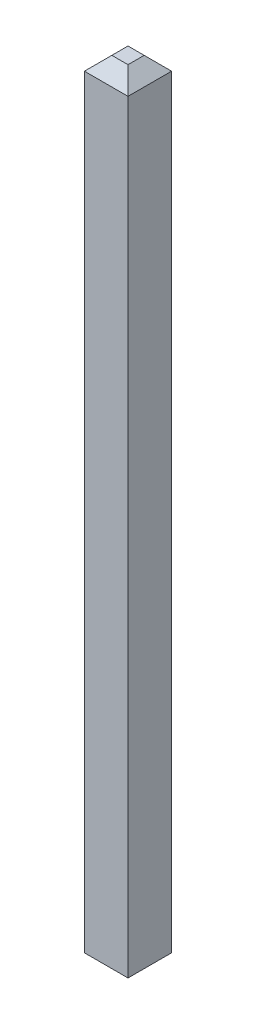
ISO-10303-21;
HEADER;
FILE_DESCRIPTION(('STEP AP214'),'2;1');
FILE_NAME('part.step','',(''),(''),'','','');
FILE_SCHEMA(('AUTOMOTIVE_DESIGN { 1 0 10303 214 1 1 1 1 }'));
ENDSEC;
DATA;
#1=APPLICATION_CONTEXT('core data for automotive mechanical design processes');
#2=APPLICATION_PROTOCOL_DEFINITION('international standard','automotive_design',2000,#1);
#3=PRODUCT_CONTEXT('',#1,'mechanical');
#4=PRODUCT('Part','Part','',(#3));
#5=PRODUCT_RELATED_PRODUCT_CATEGORY('part','',(#4));
#6=PRODUCT_DEFINITION_FORMATION('','',#4);
#7=PRODUCT_DEFINITION_CONTEXT('part definition',#1,'design');
#8=PRODUCT_DEFINITION('design','',#6,#7);
#9=PRODUCT_DEFINITION_SHAPE('','',#8);
#10=(LENGTH_UNIT() NAMED_UNIT(*) SI_UNIT(.MILLI.,.METRE.));
#11=(NAMED_UNIT(*) PLANE_ANGLE_UNIT() SI_UNIT($,.RADIAN.));
#12=(NAMED_UNIT(*) SI_UNIT($,.STERADIAN.) SOLID_ANGLE_UNIT());
#13=UNCERTAINTY_MEASURE_WITH_UNIT(LENGTH_MEASURE(1.E-05),#10,'distance_accuracy_value','');
#14=(GEOMETRIC_REPRESENTATION_CONTEXT(3) GLOBAL_UNCERTAINTY_ASSIGNED_CONTEXT((#13)) GLOBAL_UNIT_ASSIGNED_CONTEXT((#10,
#11,#12)) REPRESENTATION_CONTEXT('',''));
#15=CARTESIAN_POINT('',(0.,0.,0.));
#16=DIRECTION('',(0.,0.,1.));
#17=DIRECTION('',(1.,0.,0.));
#18=AXIS2_PLACEMENT_3D('',#15,#16,#17);
#19=CARTESIAN_POINT('',(0.,11.54,0.));
#20=DIRECTION('',(1.,0.,0.));
#21=DIRECTION('',(0.,0.,-1.));
#22=AXIS2_PLACEMENT_3D('',#19,#20,#21);
#23=PLANE('',#22);
#24=DIRECTION('',(0.,-1.,0.));
#25=VECTOR('',#24,1.);
#26=CARTESIAN_POINT('',(0.,11.54,0.636));
#27=LINE('',#26,#25);
#28=CARTESIAN_POINT('',(0.,11.34,0.636));
#29=VERTEX_POINT('',#28);
#30=CARTESIAN_POINT('',(0.,0.199999999999999,0.636));
#31=VERTEX_POINT('',#30);
#32=EDGE_CURVE('E127',#29,#31,#27,.T.);
#33=ORIENTED_EDGE('',*,*,#32,.F.);
#34=DIRECTION('',(0.,0.,-1.));
#35=VECTOR('',#34,1.);
#36=CARTESIAN_POINT('',(0.,11.34,0.));
#37=LINE('',#36,#35);
#38=CARTESIAN_POINT('',(0.,11.34,0.));
#39=VERTEX_POINT('',#38);
#40=EDGE_CURVE('E152',#29,#39,#37,.T.);
#41=ORIENTED_EDGE('',*,*,#40,.T.);
#42=DIRECTION('',(0.,-1.,0.));
#43=VECTOR('',#42,1.);
#44=CARTESIAN_POINT('',(0.,11.54,0.));
#45=LINE('',#44,#43);
#46=CARTESIAN_POINT('',(0.,0.199999999999999,0.));
#47=VERTEX_POINT('',#46);
#48=EDGE_CURVE('E121',#39,#47,#45,.T.);
#49=ORIENTED_EDGE('',*,*,#48,.T.);
#50=DIRECTION('',(0.,0.,1.));
#51=VECTOR('',#50,1.);
#52=CARTESIAN_POINT('',(0.,0.199999999999999,0.));
#53=LINE('',#52,#51);
#54=EDGE_CURVE('E149',#47,#31,#53,.T.);
#55=ORIENTED_EDGE('',*,*,#54,.T.);
#56=EDGE_LOOP('',(#33,#41,#49,#55));
#57=FACE_BOUND('',#56,.T.);
#58=ADVANCED_FACE('F35',(#57),#23,.F.);
#59=CARTESIAN_POINT('',(0.,11.54,0.636));
#60=DIRECTION('',(0.,0.,-1.));
#61=DIRECTION('',(-1.,0.,0.));
#62=AXIS2_PLACEMENT_3D('',#59,#60,#61);
#63=PLANE('',#62);
#64=DIRECTION('',(0.,-1.,0.));
#65=VECTOR('',#64,1.);
#66=CARTESIAN_POINT('',(0.636,11.54,0.636));
#67=LINE('',#66,#65);
#68=CARTESIAN_POINT('',(0.636,11.34,0.636));
#69=VERTEX_POINT('',#68);
#70=CARTESIAN_POINT('',(0.636,0.199999999999999,0.636));
#71=VERTEX_POINT('',#70);
#72=EDGE_CURVE('E130',#69,#71,#67,.T.);
#73=ORIENTED_EDGE('',*,*,#72,.F.);
#74=DIRECTION('',(-1.,0.,0.));
#75=VECTOR('',#74,1.);
#76=CARTESIAN_POINT('',(0.,11.34,0.636));
#77=LINE('',#76,#75);
#78=EDGE_CURVE('E139',#69,#29,#77,.T.);
#79=ORIENTED_EDGE('',*,*,#78,.T.);
#80=ORIENTED_EDGE('',*,*,#32,.T.);
#81=DIRECTION('',(1.,0.,0.));
#82=VECTOR('',#81,1.);
#83=CARTESIAN_POINT('',(0.,0.199999999999999,0.636));
#84=LINE('',#83,#82);
#85=EDGE_CURVE('E137',#31,#71,#84,.T.);
#86=ORIENTED_EDGE('',*,*,#85,.T.);
#87=EDGE_LOOP('',(#73,#79,#80,#86));
#88=FACE_BOUND('',#87,.T.);
#89=ADVANCED_FACE('F189',(#88),#63,.F.);
#90=CARTESIAN_POINT('',(0.636,11.54,0.));
#91=DIRECTION('',(-1.,0.,0.));
#92=DIRECTION('',(0.,0.,1.));
#93=AXIS2_PLACEMENT_3D('',#90,#91,#92);
#94=PLANE('',#93);
#95=DIRECTION('',(0.,-1.,0.));
#96=VECTOR('',#95,1.);
#97=CARTESIAN_POINT('',(0.636,11.54,0.));
#98=LINE('',#97,#96);
#99=CARTESIAN_POINT('',(0.636,11.34,0.));
#100=VERTEX_POINT('',#99);
#101=CARTESIAN_POINT('',(0.636,0.199999999999999,0.));
#102=VERTEX_POINT('',#101);
#103=EDGE_CURVE('E201',#100,#102,#98,.T.);
#104=ORIENTED_EDGE('',*,*,#103,.F.);
#105=DIRECTION('',(0.,0.,1.));
#106=VECTOR('',#105,1.);
#107=CARTESIAN_POINT('',(0.636,11.34,0.636));
#108=LINE('',#107,#106);
#109=EDGE_CURVE('E144',#100,#69,#108,.T.);
#110=ORIENTED_EDGE('',*,*,#109,.T.);
#111=ORIENTED_EDGE('',*,*,#72,.T.);
#112=DIRECTION('',(0.,0.,-1.));
#113=VECTOR('',#112,1.);
#114=CARTESIAN_POINT('',(0.636,0.199999999999999,0.));
#115=LINE('',#114,#113);
#116=EDGE_CURVE('E142',#71,#102,#115,.T.);
#117=ORIENTED_EDGE('',*,*,#116,.T.);
#118=EDGE_LOOP('',(#104,#110,#111,#117));
#119=FACE_BOUND('',#118,.T.);
#120=ADVANCED_FACE('F199',(#119),#94,.F.);
#121=CARTESIAN_POINT('',(0.,11.54,0.));
#122=DIRECTION('',(0.,0.,1.));
#123=DIRECTION('',(1.,0.,0.));
#124=AXIS2_PLACEMENT_3D('',#121,#122,#123);
#125=PLANE('',#124);
#126=ORIENTED_EDGE('',*,*,#48,.F.);
#127=DIRECTION('',(1.,0.,0.));
#128=VECTOR('',#127,1.);
#129=CARTESIAN_POINT('',(0.636,11.34,0.));
#130=LINE('',#129,#128);
#131=EDGE_CURVE('E118',#39,#100,#130,.T.);
#132=ORIENTED_EDGE('',*,*,#131,.T.);
#133=ORIENTED_EDGE('',*,*,#103,.T.);
#134=DIRECTION('',(-1.,0.,0.));
#135=VECTOR('',#134,1.);
#136=CARTESIAN_POINT('',(0.,0.199999999999999,0.));
#137=LINE('',#136,#135);
#138=EDGE_CURVE('E146',#102,#47,#137,.T.);
#139=ORIENTED_EDGE('',*,*,#138,.T.);
#140=EDGE_LOOP('',(#126,#132,#133,#139));
#141=FACE_BOUND('',#140,.T.);
#142=ADVANCED_FACE('F205',(#141),#125,.F.);
#143=CARTESIAN_POINT('',(0.,11.54,0.));
#144=DIRECTION('',(0.,1.,0.));
#145=DIRECTION('',(0.,0.,1.));
#146=AXIS2_PLACEMENT_3D('',#143,#144,#145);
#147=PLANE('',#146);
#148=DIRECTION('',(0.,0.,1.));
#149=VECTOR('',#148,1.);
#150=CARTESIAN_POINT('',(0.199999999999999,11.54,0.636));
#151=LINE('',#150,#149);
#152=CARTESIAN_POINT('',(0.199999999999999,11.54,0.199999999999999));
#153=VERTEX_POINT('',#152);
#154=CARTESIAN_POINT('',(0.199999999999999,11.54,0.436000000000001));
#155=VERTEX_POINT('',#154);
#156=EDGE_CURVE('E106',#153,#155,#151,.T.);
#157=ORIENTED_EDGE('',*,*,#156,.T.);
#158=DIRECTION('',(1.,0.,0.));
#159=VECTOR('',#158,1.);
#160=CARTESIAN_POINT('',(0.636,11.54,0.436000000000001));
#161=LINE('',#160,#159);
#162=CARTESIAN_POINT('',(0.436000000000001,11.54,0.436000000000001));
#163=VERTEX_POINT('',#162);
#164=EDGE_CURVE('E135',#155,#163,#161,.T.);
#165=ORIENTED_EDGE('',*,*,#164,.T.);
#166=DIRECTION('',(0.,0.,-1.));
#167=VECTOR('',#166,1.);
#168=CARTESIAN_POINT('',(0.436000000000001,11.54,0.));
#169=LINE('',#168,#167);
#170=CARTESIAN_POINT('',(0.436000000000001,11.54,0.199999999999999));
#171=VERTEX_POINT('',#170);
#172=EDGE_CURVE('E109',#163,#171,#169,.T.);
#173=ORIENTED_EDGE('',*,*,#172,.T.);
#174=DIRECTION('',(-1.,0.,0.));
#175=VECTOR('',#174,1.);
#176=CARTESIAN_POINT('',(0.,11.54,0.199999999999999));
#177=LINE('',#176,#175);
#178=EDGE_CURVE('E101',#171,#153,#177,.T.);
#179=ORIENTED_EDGE('',*,*,#178,.T.);
#180=EDGE_LOOP('',(#157,#165,#173,#179));
#181=FACE_BOUND('',#180,.T.);
#182=ADVANCED_FACE('F103',(#181),#147,.T.);
#183=CARTESIAN_POINT('',(0.,0.,0.));
#184=DIRECTION('',(0.,1.,0.));
#185=DIRECTION('',(0.,0.,1.));
#186=AXIS2_PLACEMENT_3D('',#183,#184,#185);
#187=PLANE('',#186);
#188=DIRECTION('',(-1.,0.,0.));
#189=VECTOR('',#188,1.);
#190=CARTESIAN_POINT('',(0.,0.,0.436000000000001));
#191=LINE('',#190,#189);
#192=CARTESIAN_POINT('',(0.436000000000001,0.,0.436000000000001));
#193=VERTEX_POINT('',#192);
#194=CARTESIAN_POINT('',(0.199999999999999,0.,0.436000000000001));
#195=VERTEX_POINT('',#194);
#196=EDGE_CURVE('E154',#193,#195,#191,.T.);
#197=ORIENTED_EDGE('',*,*,#196,.T.);
#198=DIRECTION('',(0.,0.,-1.));
#199=VECTOR('',#198,1.);
#200=CARTESIAN_POINT('',(0.199999999999999,0.,0.));
#201=LINE('',#200,#199);
#202=CARTESIAN_POINT('',(0.199999999999999,0.,0.199999999999999));
#203=VERTEX_POINT('',#202);
#204=EDGE_CURVE('E11',#195,#203,#201,.T.);
#205=ORIENTED_EDGE('',*,*,#204,.T.);
#206=DIRECTION('',(1.,0.,0.));
#207=VECTOR('',#206,1.);
#208=CARTESIAN_POINT('',(0.,0.,0.199999999999999));
#209=LINE('',#208,#207);
#210=CARTESIAN_POINT('',(0.436000000000001,0.,0.199999999999999));
#211=VERTEX_POINT('',#210);
#212=EDGE_CURVE('E44',#203,#211,#209,.T.);
#213=ORIENTED_EDGE('',*,*,#212,.T.);
#214=DIRECTION('',(0.,0.,1.));
#215=VECTOR('',#214,1.);
#216=CARTESIAN_POINT('',(0.436000000000001,0.,0.));
#217=LINE('',#216,#215);
#218=EDGE_CURVE('E156',#211,#193,#217,.T.);
#219=ORIENTED_EDGE('',*,*,#218,.T.);
#220=EDGE_LOOP('',(#197,#205,#213,#219));
#221=FACE_BOUND('',#220,.T.);
#222=ADVANCED_FACE('F178',(#221),#187,.F.);
#223=CARTESIAN_POINT('',(0.,11.54,0.199999999999999));
#224=DIRECTION('',(0.,0.707106781186548,-0.707106781186548));
#225=DIRECTION('',(1.,0.,0.));
#226=AXIS2_PLACEMENT_3D('',#223,#224,#225);
#227=PLANE('',#226);
#228=DIRECTION('',(0.577350269189626,-0.577350269189626,-0.577350269189626));
#229=VECTOR('',#228,1.);
#230=CARTESIAN_POINT('',(0.290666666666668,11.6853333333333,0.345333333333333));
#231=LINE('',#230,#229);
#232=EDGE_CURVE('E122',#100,#171,#231,.F.);
#233=ORIENTED_EDGE('',*,*,#232,.F.);
#234=ORIENTED_EDGE('',*,*,#131,.F.);
#235=DIRECTION('',(-0.577350269189626,-0.577350269189626,-0.577350269189626));
#236=VECTOR('',#235,1.);
#237=CARTESIAN_POINT('',(0.133333333333333,11.4733333333333,0.133333333333332));
#238=LINE('',#237,#236);
#239=EDGE_CURVE('E116',#153,#39,#238,.T.);
#240=ORIENTED_EDGE('',*,*,#239,.F.);
#241=ORIENTED_EDGE('',*,*,#178,.F.);
#242=EDGE_LOOP('',(#233,#234,#240,#241));
#243=FACE_BOUND('',#242,.T.);
#244=ADVANCED_FACE('F117',(#243),#227,.T.);
#245=CARTESIAN_POINT('',(0.199999999999999,11.54,0.));
#246=DIRECTION('',(-0.707106781186548,0.707106781186548,0.));
#247=DIRECTION('',(0.,0.,-1.));
#248=AXIS2_PLACEMENT_3D('',#245,#246,#247);
#249=PLANE('',#248);
#250=ORIENTED_EDGE('',*,*,#239,.T.);
#251=ORIENTED_EDGE('',*,*,#40,.F.);
#252=DIRECTION('',(0.577350269189626,0.577350269189626,-0.577350269189626));
#253=VECTOR('',#252,1.);
#254=CARTESIAN_POINT('',(0.345333333333333,11.6853333333333,0.290666666666668));
#255=LINE('',#254,#253);
#256=EDGE_CURVE('E125',#155,#29,#255,.F.);
#257=ORIENTED_EDGE('',*,*,#256,.F.);
#258=ORIENTED_EDGE('',*,*,#156,.F.);
#259=EDGE_LOOP('',(#250,#251,#257,#258));
#260=FACE_BOUND('',#259,.T.);
#261=ADVANCED_FACE('F124',(#260),#249,.T.);
#262=CARTESIAN_POINT('',(0.436000000000001,11.54,0.));
#263=DIRECTION('',(0.707106781186548,0.707106781186548,0.));
#264=DIRECTION('',(0.,0.,1.));
#265=AXIS2_PLACEMENT_3D('',#262,#263,#264);
#266=PLANE('',#265);
#267=ORIENTED_EDGE('',*,*,#232,.T.);
#268=ORIENTED_EDGE('',*,*,#172,.F.);
#269=DIRECTION('',(0.577350269189626,-0.577350269189626,0.577350269189626));
#270=VECTOR('',#269,1.);
#271=CARTESIAN_POINT('',(0.290666666666668,11.6853333333333,0.290666666666667));
#272=LINE('',#271,#270);
#273=EDGE_CURVE('E159',#69,#163,#272,.F.);
#274=ORIENTED_EDGE('',*,*,#273,.F.);
#275=ORIENTED_EDGE('',*,*,#109,.F.);
#276=EDGE_LOOP('',(#267,#268,#274,#275));
#277=FACE_BOUND('',#276,.T.);
#278=ADVANCED_FACE('F196',(#277),#266,.T.);
#279=CARTESIAN_POINT('',(0.,11.54,0.436000000000001));
#280=DIRECTION('',(0.,0.707106781186548,0.707106781186548));
#281=DIRECTION('',(-1.,0.,0.));
#282=AXIS2_PLACEMENT_3D('',#279,#280,#281);
#283=PLANE('',#282);
#284=ORIENTED_EDGE('',*,*,#256,.T.);
#285=ORIENTED_EDGE('',*,*,#78,.F.);
#286=ORIENTED_EDGE('',*,*,#273,.T.);
#287=ORIENTED_EDGE('',*,*,#164,.F.);
#288=EDGE_LOOP('',(#284,#285,#286,#287));
#289=FACE_BOUND('',#288,.T.);
#290=ADVANCED_FACE('F193',(#289),#283,.T.);
#291=CARTESIAN_POINT('',(0.636,0.199999999999999,0.));
#292=DIRECTION('',(-0.707106781186548,0.707106781186548,0.));
#293=DIRECTION('',(0.,0.,-1.));
#294=AXIS2_PLACEMENT_3D('',#291,#292,#293);
#295=PLANE('',#294);
#296=DIRECTION('',(0.577350269189626,0.577350269189626,0.577350269189626));
#297=VECTOR('',#296,1.);
#298=CARTESIAN_POINT('',(0.424,-0.0120000000000012,0.424));
#299=LINE('',#298,#297);
#300=EDGE_CURVE('E165',#193,#71,#299,.T.);
#301=ORIENTED_EDGE('',*,*,#300,.F.);
#302=ORIENTED_EDGE('',*,*,#218,.F.);
#303=DIRECTION('',(0.577350269189626,0.577350269189626,-0.577350269189626));
#304=VECTOR('',#303,1.);
#305=CARTESIAN_POINT('',(0.636,0.199999999999999,0.));
#306=LINE('',#305,#304);
#307=EDGE_CURVE('E39',#102,#211,#306,.F.);
#308=ORIENTED_EDGE('',*,*,#307,.F.);
#309=ORIENTED_EDGE('',*,*,#116,.F.);
#310=EDGE_LOOP('',(#301,#302,#308,#309));
#311=FACE_BOUND('',#310,.T.);
#312=ADVANCED_FACE('F37',(#311),#295,.F.);
#313=CARTESIAN_POINT('',(0.,0.199999999999999,0.));
#314=DIRECTION('',(0.,0.707106781186548,0.707106781186548));
#315=DIRECTION('',(-1.,0.,0.));
#316=AXIS2_PLACEMENT_3D('',#313,#314,#315);
#317=PLANE('',#316);
#318=ORIENTED_EDGE('',*,*,#307,.T.);
#319=ORIENTED_EDGE('',*,*,#212,.F.);
#320=DIRECTION('',(-0.577350269189626,0.577350269189626,-0.577350269189626));
#321=VECTOR('',#320,1.);
#322=CARTESIAN_POINT('',(0.,0.199999999999999,0.));
#323=LINE('',#322,#321);
#324=EDGE_CURVE('E52',#47,#203,#323,.F.);
#325=ORIENTED_EDGE('',*,*,#324,.F.);
#326=ORIENTED_EDGE('',*,*,#138,.F.);
#327=EDGE_LOOP('',(#318,#319,#325,#326));
#328=FACE_BOUND('',#327,.T.);
#329=ADVANCED_FACE('F175',(#328),#317,.F.);
#330=CARTESIAN_POINT('',(0.,0.199999999999999,0.636));
#331=DIRECTION('',(0.,0.707106781186548,-0.707106781186548));
#332=DIRECTION('',(1.,0.,0.));
#333=AXIS2_PLACEMENT_3D('',#330,#331,#332);
#334=PLANE('',#333);
#335=ORIENTED_EDGE('',*,*,#300,.T.);
#336=ORIENTED_EDGE('',*,*,#85,.F.);
#337=DIRECTION('',(0.577350269189626,-0.577350269189626,-0.577350269189626));
#338=VECTOR('',#337,1.);
#339=CARTESIAN_POINT('',(0.,0.199999999999999,0.636));
#340=LINE('',#339,#338);
#341=EDGE_CURVE('E163',#195,#31,#340,.F.);
#342=ORIENTED_EDGE('',*,*,#341,.F.);
#343=ORIENTED_EDGE('',*,*,#196,.F.);
#344=EDGE_LOOP('',(#335,#336,#342,#343));
#345=FACE_BOUND('',#344,.T.);
#346=ADVANCED_FACE('F181',(#345),#334,.F.);
#347=CARTESIAN_POINT('',(0.,0.199999999999999,0.));
#348=DIRECTION('',(0.707106781186548,0.707106781186548,0.));
#349=DIRECTION('',(0.,0.,1.));
#350=AXIS2_PLACEMENT_3D('',#347,#348,#349);
#351=PLANE('',#350);
#352=ORIENTED_EDGE('',*,*,#324,.T.);
#353=ORIENTED_EDGE('',*,*,#204,.F.);
#354=ORIENTED_EDGE('',*,*,#341,.T.);
#355=ORIENTED_EDGE('',*,*,#54,.F.);
#356=EDGE_LOOP('',(#352,#353,#354,#355));
#357=FACE_BOUND('',#356,.T.);
#358=ADVANCED_FACE('F180',(#357),#351,.F.);
#359=CLOSED_SHELL('',(#58,#89,#120,#142,#182,#222,#244,#261,#278,#290,#312,#329,#346,#358));
#360=MANIFOLD_SOLID_BREP('B2',#359);
#361=ADVANCED_BREP_SHAPE_REPRESENTATION('',(#18,#360),#14);
#362=SHAPE_DEFINITION_REPRESENTATION(#9,#361);
ENDSEC;
END-ISO-10303-21;
